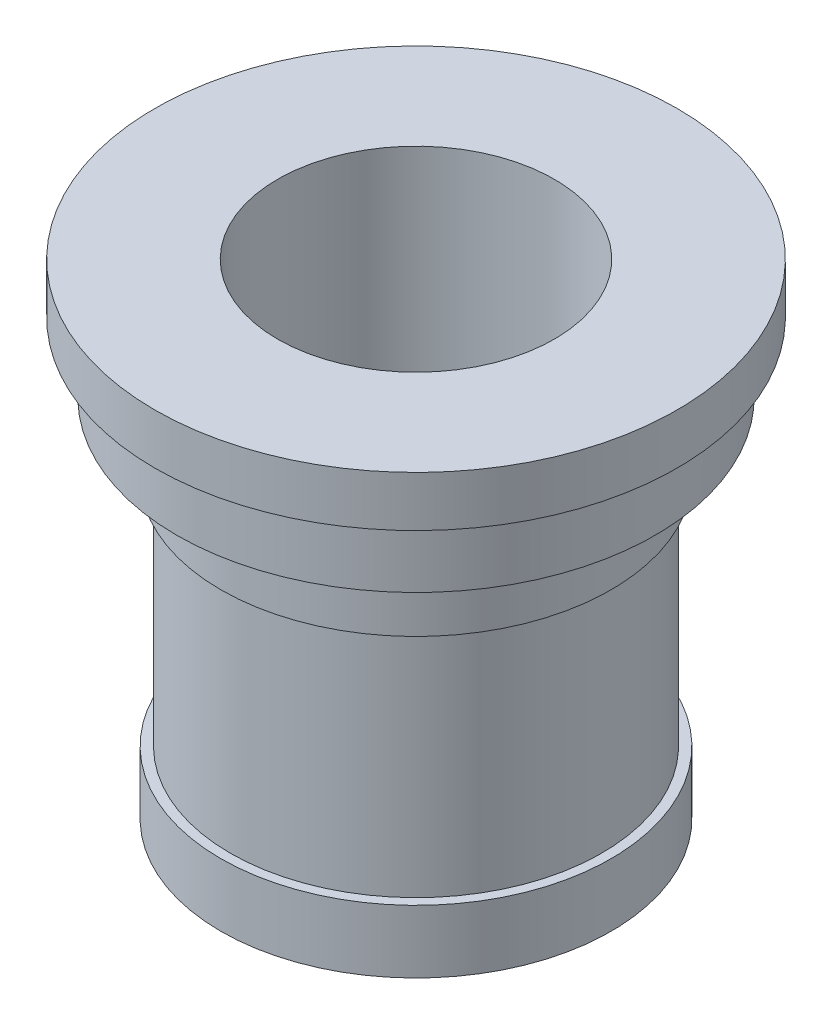
ISO-10303-21;
HEADER;
FILE_DESCRIPTION(('STEP AP214'),'2;1');
FILE_NAME('part.step','',(''),(''),'','','');
FILE_SCHEMA(('AUTOMOTIVE_DESIGN { 1 0 10303 214 1 1 1 1 }'));
ENDSEC;
DATA;
#1=APPLICATION_CONTEXT('core data for automotive mechanical design processes');
#2=APPLICATION_PROTOCOL_DEFINITION('international standard','automotive_design',2000,#1);
#3=PRODUCT_CONTEXT('',#1,'mechanical');
#4=PRODUCT('Part','Part','',(#3));
#5=PRODUCT_RELATED_PRODUCT_CATEGORY('part','',(#4));
#6=PRODUCT_DEFINITION_FORMATION('','',#4);
#7=PRODUCT_DEFINITION_CONTEXT('part definition',#1,'design');
#8=PRODUCT_DEFINITION('design','',#6,#7);
#9=PRODUCT_DEFINITION_SHAPE('','',#8);
#10=(LENGTH_UNIT() NAMED_UNIT(*) SI_UNIT(.MILLI.,.METRE.));
#11=(NAMED_UNIT(*) PLANE_ANGLE_UNIT() SI_UNIT($,.RADIAN.));
#12=(NAMED_UNIT(*) SI_UNIT($,.STERADIAN.) SOLID_ANGLE_UNIT());
#13=UNCERTAINTY_MEASURE_WITH_UNIT(LENGTH_MEASURE(1.E-05),#10,'distance_accuracy_value','');
#14=(GEOMETRIC_REPRESENTATION_CONTEXT(3) GLOBAL_UNCERTAINTY_ASSIGNED_CONTEXT((#13)) GLOBAL_UNIT_ASSIGNED_CONTEXT((#10,
#11,#12)) REPRESENTATION_CONTEXT('',''));
#15=CARTESIAN_POINT('',(0.,0.,0.));
#16=DIRECTION('',(0.,0.,1.));
#17=DIRECTION('',(1.,0.,0.));
#18=AXIS2_PLACEMENT_3D('',#15,#16,#17);
#19=CARTESIAN_POINT('',(0.,10.,0.));
#20=DIRECTION('',(0.,-1.,0.));
#21=DIRECTION('',(0.,0.,-1.));
#22=AXIS2_PLACEMENT_3D('',#19,#20,#21);
#23=CYLINDRICAL_SURFACE('',#22,31.);
#24=CARTESIAN_POINT('',(0.,10.,0.));
#25=DIRECTION('',(0.,1.,0.));
#26=DIRECTION('',(0.,0.,1.));
#27=AXIS2_PLACEMENT_3D('',#24,#25,#26);
#28=CIRCLE('',#27,31.);
#29=CARTESIAN_POINT('',(0.,10.,31.));
#30=VERTEX_POINT('',#29);
#31=EDGE_CURVE('E102',#30,#30,#28,.T.);
#32=ORIENTED_EDGE('',*,*,#31,.F.);
#33=EDGE_LOOP('',(#32));
#34=FACE_BOUND('',#33,.T.);
#35=CARTESIAN_POINT('',(0.,0.,0.));
#36=DIRECTION('',(0.,1.,0.));
#37=DIRECTION('',(0.,0.,1.));
#38=AXIS2_PLACEMENT_3D('',#35,#36,#37);
#39=CIRCLE('',#38,31.);
#40=CARTESIAN_POINT('',(0.,0.,31.));
#41=VERTEX_POINT('',#40);
#42=EDGE_CURVE('E99',#41,#41,#39,.T.);
#43=ORIENTED_EDGE('',*,*,#42,.T.);
#44=EDGE_LOOP('',(#43));
#45=FACE_BOUND('',#44,.T.);
#46=ADVANCED_FACE('F33',(#34,#45),#23,.T.);
#47=CARTESIAN_POINT('',(0.,10.,0.));
#48=DIRECTION('',(0.,1.,0.));
#49=DIRECTION('',(0.,0.,1.));
#50=AXIS2_PLACEMENT_3D('',#47,#48,#49);
#51=PLANE('',#50);
#52=CARTESIAN_POINT('',(0.,10.,0.));
#53=DIRECTION('',(0.,1.,0.));
#54=DIRECTION('',(0.,0.,1.));
#55=AXIS2_PLACEMENT_3D('',#52,#53,#54);
#56=CIRCLE('',#55,29.5);
#57=CARTESIAN_POINT('',(0.,10.,29.5));
#58=VERTEX_POINT('',#57);
#59=EDGE_CURVE('E93',#58,#58,#56,.T.);
#60=ORIENTED_EDGE('',*,*,#59,.F.);
#61=EDGE_LOOP('',(#60));
#62=FACE_BOUND('',#61,.T.);
#63=ORIENTED_EDGE('',*,*,#31,.T.);
#64=EDGE_LOOP('',(#63));
#65=FACE_BOUND('',#64,.T.);
#66=ADVANCED_FACE('F111',(#62,#65),#51,.T.);
#67=CARTESIAN_POINT('',(0.,0.,0.));
#68=DIRECTION('',(0.,1.,0.));
#69=DIRECTION('',(0.,0.,1.));
#70=AXIS2_PLACEMENT_3D('',#67,#68,#69);
#71=PLANE('',#70);
#72=CARTESIAN_POINT('',(0.,0.,0.));
#73=DIRECTION('',(0.,1.,0.));
#74=DIRECTION('',(0.,0.,1.));
#75=AXIS2_PLACEMENT_3D('',#72,#73,#74);
#76=CIRCLE('',#75,22.);
#77=CARTESIAN_POINT('',(1.49912810403716,0.,21.9488636363636));
#78=VERTEX_POINT('',#77);
#79=CARTESIAN_POINT('',(-1.49912810403716,0.,21.9488636363636));
#80=VERTEX_POINT('',#79);
#81=EDGE_CURVE('E67',#78,#80,#76,.T.);
#82=ORIENTED_EDGE('',*,*,#81,.T.);
#83=CARTESIAN_POINT('',(0.,0.,22.));
#84=DIRECTION('',(0.,-1.,0.));
#85=DIRECTION('',(0.,0.,-1.));
#86=AXIS2_PLACEMENT_3D('',#83,#84,#85);
#87=CIRCLE('',#86,1.5);
#88=EDGE_CURVE('E59',#78,#80,#87,.T.);
#89=ORIENTED_EDGE('',*,*,#88,.F.);
#90=EDGE_LOOP('',(#82,#89));
#91=FACE_BOUND('',#90,.T.);
#92=ORIENTED_EDGE('',*,*,#42,.F.);
#93=EDGE_LOOP('',(#92));
#94=FACE_BOUND('',#93,.T.);
#95=ADVANCED_FACE('F65',(#91,#94),#71,.F.);
#96=CARTESIAN_POINT('',(0.,47.,0.));
#97=DIRECTION('',(0.,-1.,0.));
#98=DIRECTION('',(0.,0.,-1.));
#99=AXIS2_PLACEMENT_3D('',#96,#97,#98);
#100=CYLINDRICAL_SURFACE('',#99,29.5);
#101=CARTESIAN_POINT('',(0.,47.,0.));
#102=DIRECTION('',(0.,1.,0.));
#103=DIRECTION('',(0.,0.,1.));
#104=AXIS2_PLACEMENT_3D('',#101,#102,#103);
#105=CIRCLE('',#104,29.5);
#106=CARTESIAN_POINT('',(0.,47.,29.5));
#107=VERTEX_POINT('',#106);
#108=EDGE_CURVE('E96',#107,#107,#105,.T.);
#109=ORIENTED_EDGE('',*,*,#108,.F.);
#110=EDGE_LOOP('',(#109));
#111=FACE_BOUND('',#110,.T.);
#112=ORIENTED_EDGE('',*,*,#59,.T.);
#113=EDGE_LOOP('',(#112));
#114=FACE_BOUND('',#113,.T.);
#115=ADVANCED_FACE('F110',(#111,#114),#100,.T.);
#116=CARTESIAN_POINT('',(0.,58.,0.));
#117=DIRECTION('',(0.,-1.,0.));
#118=DIRECTION('',(0.,0.,-1.));
#119=AXIS2_PLACEMENT_3D('',#116,#117,#118);
#120=CYLINDRICAL_SURFACE('',#119,31.);
#121=CARTESIAN_POINT('',(0.,58.,0.));
#122=DIRECTION('',(0.,1.,0.));
#123=DIRECTION('',(0.,0.,1.));
#124=AXIS2_PLACEMENT_3D('',#121,#122,#123);
#125=CIRCLE('',#124,31.);
#126=CARTESIAN_POINT('',(0.,58.,31.));
#127=VERTEX_POINT('',#126);
#128=EDGE_CURVE('E90',#127,#127,#125,.T.);
#129=ORIENTED_EDGE('',*,*,#128,.F.);
#130=EDGE_LOOP('',(#129));
#131=FACE_BOUND('',#130,.T.);
#132=CARTESIAN_POINT('',(0.,47.,0.));
#133=DIRECTION('',(0.,1.,0.));
#134=DIRECTION('',(0.,0.,1.));
#135=AXIS2_PLACEMENT_3D('',#132,#133,#134);
#136=CIRCLE('',#135,31.);
#137=CARTESIAN_POINT('',(0.,47.,31.));
#138=VERTEX_POINT('',#137);
#139=EDGE_CURVE('E87',#138,#138,#136,.T.);
#140=ORIENTED_EDGE('',*,*,#139,.T.);
#141=EDGE_LOOP('',(#140));
#142=FACE_BOUND('',#141,.T.);
#143=ADVANCED_FACE('F116',(#131,#142),#120,.T.);
#144=CARTESIAN_POINT('',(0.,47.,0.));
#145=DIRECTION('',(0.,1.,0.));
#146=DIRECTION('',(0.,0.,1.));
#147=AXIS2_PLACEMENT_3D('',#144,#145,#146);
#148=PLANE('',#147);
#149=ORIENTED_EDGE('',*,*,#108,.T.);
#150=EDGE_LOOP('',(#149));
#151=FACE_BOUND('',#150,.T.);
#152=ORIENTED_EDGE('',*,*,#139,.F.);
#153=EDGE_LOOP('',(#152));
#154=FACE_BOUND('',#153,.T.);
#155=ADVANCED_FACE('F147',(#151,#154),#148,.F.);
#156=CARTESIAN_POINT('',(0.,69.,0.));
#157=DIRECTION('',(0.,-1.,0.));
#158=DIRECTION('',(0.,0.,-1.));
#159=AXIS2_PLACEMENT_3D('',#156,#157,#158);
#160=CYLINDRICAL_SURFACE('',#159,38.);
#161=CARTESIAN_POINT('',(0.,69.,0.));
#162=DIRECTION('',(0.,1.,0.));
#163=DIRECTION('',(0.,0.,1.));
#164=AXIS2_PLACEMENT_3D('',#161,#162,#163);
#165=CIRCLE('',#164,38.);
#166=CARTESIAN_POINT('',(0.,69.,38.));
#167=VERTEX_POINT('',#166);
#168=EDGE_CURVE('E84',#167,#167,#165,.T.);
#169=ORIENTED_EDGE('',*,*,#168,.F.);
#170=EDGE_LOOP('',(#169));
#171=FACE_BOUND('',#170,.T.);
#172=CARTESIAN_POINT('',(0.,58.,0.));
#173=DIRECTION('',(0.,1.,0.));
#174=DIRECTION('',(0.,0.,1.));
#175=AXIS2_PLACEMENT_3D('',#172,#173,#174);
#176=CIRCLE('',#175,38.);
#177=CARTESIAN_POINT('',(0.,58.,38.));
#178=VERTEX_POINT('',#177);
#179=EDGE_CURVE('E82',#178,#178,#176,.T.);
#180=ORIENTED_EDGE('',*,*,#179,.T.);
#181=EDGE_LOOP('',(#180));
#182=FACE_BOUND('',#181,.T.);
#183=ADVANCED_FACE('F157',(#171,#182),#160,.T.);
#184=CARTESIAN_POINT('',(0.,58.,0.));
#185=DIRECTION('',(0.,1.,0.));
#186=DIRECTION('',(0.,0.,1.));
#187=AXIS2_PLACEMENT_3D('',#184,#185,#186);
#188=PLANE('',#187);
#189=ORIENTED_EDGE('',*,*,#128,.T.);
#190=EDGE_LOOP('',(#189));
#191=FACE_BOUND('',#190,.T.);
#192=ORIENTED_EDGE('',*,*,#179,.F.);
#193=EDGE_LOOP('',(#192));
#194=FACE_BOUND('',#193,.T.);
#195=ADVANCED_FACE('F167',(#191,#194),#188,.F.);
#196=CARTESIAN_POINT('',(0.,77.,0.));
#197=DIRECTION('',(0.,-1.,0.));
#198=DIRECTION('',(0.,0.,-1.));
#199=AXIS2_PLACEMENT_3D('',#196,#197,#198);
#200=CYLINDRICAL_SURFACE('',#199,41.5);
#201=CARTESIAN_POINT('',(0.,77.,0.));
#202=DIRECTION('',(0.,1.,0.));
#203=DIRECTION('',(0.,0.,1.));
#204=AXIS2_PLACEMENT_3D('',#201,#202,#203);
#205=CIRCLE('',#204,41.5);
#206=CARTESIAN_POINT('',(0.,77.,41.5));
#207=VERTEX_POINT('',#206);
#208=EDGE_CURVE('E75',#207,#207,#205,.T.);
#209=ORIENTED_EDGE('',*,*,#208,.F.);
#210=EDGE_LOOP('',(#209));
#211=FACE_BOUND('',#210,.T.);
#212=CARTESIAN_POINT('',(0.,69.,0.));
#213=DIRECTION('',(0.,1.,0.));
#214=DIRECTION('',(0.,0.,1.));
#215=AXIS2_PLACEMENT_3D('',#212,#213,#214);
#216=CIRCLE('',#215,41.5);
#217=CARTESIAN_POINT('',(0.,69.,41.5));
#218=VERTEX_POINT('',#217);
#219=EDGE_CURVE('E71',#218,#218,#216,.T.);
#220=ORIENTED_EDGE('',*,*,#219,.T.);
#221=EDGE_LOOP('',(#220));
#222=FACE_BOUND('',#221,.T.);
#223=ADVANCED_FACE('F177',(#211,#222),#200,.T.);
#224=CARTESIAN_POINT('',(0.,77.,0.));
#225=DIRECTION('',(0.,1.,0.));
#226=DIRECTION('',(0.,0.,1.));
#227=AXIS2_PLACEMENT_3D('',#224,#225,#226);
#228=PLANE('',#227);
#229=CARTESIAN_POINT('',(0.,77.,0.));
#230=DIRECTION('',(0.,1.,0.));
#231=DIRECTION('',(0.,0.,1.));
#232=AXIS2_PLACEMENT_3D('',#229,#230,#231);
#233=CIRCLE('',#232,22.);
#234=CARTESIAN_POINT('',(0.,77.,22.));
#235=VERTEX_POINT('',#234);
#236=EDGE_CURVE('E72',#235,#235,#233,.T.);
#237=ORIENTED_EDGE('',*,*,#236,.F.);
#238=EDGE_LOOP('',(#237));
#239=FACE_BOUND('',#238,.T.);
#240=ORIENTED_EDGE('',*,*,#208,.T.);
#241=EDGE_LOOP('',(#240));
#242=FACE_BOUND('',#241,.T.);
#243=ADVANCED_FACE('F187',(#239,#242),#228,.T.);
#244=CARTESIAN_POINT('',(0.,69.,0.));
#245=DIRECTION('',(0.,1.,0.));
#246=DIRECTION('',(0.,0.,1.));
#247=AXIS2_PLACEMENT_3D('',#244,#245,#246);
#248=PLANE('',#247);
#249=ORIENTED_EDGE('',*,*,#168,.T.);
#250=EDGE_LOOP('',(#249));
#251=FACE_BOUND('',#250,.T.);
#252=ORIENTED_EDGE('',*,*,#219,.F.);
#253=EDGE_LOOP('',(#252));
#254=FACE_BOUND('',#253,.T.);
#255=ADVANCED_FACE('F195',(#251,#254),#248,.F.);
#256=CARTESIAN_POINT('',(0.,0.,0.));
#257=DIRECTION('',(0.,1.,0.));
#258=DIRECTION('',(0.,0.,1.));
#259=AXIS2_PLACEMENT_3D('',#256,#257,#258);
#260=CYLINDRICAL_SURFACE('',#259,22.);
#261=ORIENTED_EDGE('',*,*,#81,.F.);
#262=DIRECTION('',(0.,-1.,0.));
#263=VECTOR('',#262,1.);
#264=CARTESIAN_POINT('',(1.49912810403716,2.5,21.9488636363636));
#265=LINE('',#264,#263);
#266=CARTESIAN_POINT('',(1.49912810403716,5.,21.9488636363636));
#267=VERTEX_POINT('',#266);
#268=EDGE_CURVE('E11',#78,#267,#265,.F.);
#269=ORIENTED_EDGE('',*,*,#268,.T.);
#270=CARTESIAN_POINT('',(0.,5.,0.));
#271=DIRECTION('',(0.,-1.,0.));
#272=DIRECTION('',(0.,0.,-1.));
#273=AXIS2_PLACEMENT_3D('',#270,#271,#272);
#274=CIRCLE('',#273,22.);
#275=CARTESIAN_POINT('',(-1.49912810403716,5.,21.9488636363636));
#276=VERTEX_POINT('',#275);
#277=EDGE_CURVE('E50',#276,#267,#274,.F.);
#278=ORIENTED_EDGE('',*,*,#277,.F.);
#279=DIRECTION('',(0.,-1.,0.));
#280=VECTOR('',#279,1.);
#281=CARTESIAN_POINT('',(-1.49912810403716,2.5,21.9488636363636));
#282=LINE('',#281,#280);
#283=EDGE_CURVE('E40',#276,#80,#282,.T.);
#284=ORIENTED_EDGE('',*,*,#283,.T.);
#285=EDGE_LOOP('',(#261,#269,#278,#284));
#286=FACE_BOUND('',#285,.T.);
#287=ORIENTED_EDGE('',*,*,#236,.T.);
#288=EDGE_LOOP('',(#287));
#289=FACE_BOUND('',#288,.T.);
#290=ADVANCED_FACE('F69',(#286,#289),#260,.F.);
#291=CARTESIAN_POINT('',(0.,5.,22.));
#292=DIRECTION('',(0.,-1.,0.));
#293=DIRECTION('',(0.,0.,-1.));
#294=AXIS2_PLACEMENT_3D('',#291,#292,#293);
#295=CYLINDRICAL_SURFACE('',#294,1.5);
#296=ORIENTED_EDGE('',*,*,#88,.T.);
#297=ORIENTED_EDGE('',*,*,#283,.F.);
#298=CARTESIAN_POINT('',(0.,5.,22.));
#299=DIRECTION('',(0.,-1.,0.));
#300=DIRECTION('',(0.,0.,-1.));
#301=AXIS2_PLACEMENT_3D('',#298,#299,#300);
#302=CIRCLE('',#301,1.5);
#303=EDGE_CURVE('E46',#267,#276,#302,.T.);
#304=ORIENTED_EDGE('',*,*,#303,.F.);
#305=ORIENTED_EDGE('',*,*,#268,.F.);
#306=EDGE_LOOP('',(#296,#297,#304,#305));
#307=FACE_BOUND('',#306,.T.);
#308=ADVANCED_FACE('F58',(#307),#295,.F.);
#309=CARTESIAN_POINT('',(0.,5.,22.));
#310=DIRECTION('',(0.,-1.,0.));
#311=DIRECTION('',(0.,0.,-1.));
#312=AXIS2_PLACEMENT_3D('',#309,#310,#311);
#313=PLANE('',#312);
#314=ORIENTED_EDGE('',*,*,#277,.T.);
#315=ORIENTED_EDGE('',*,*,#303,.T.);
#316=EDGE_LOOP('',(#314,#315));
#317=FACE_BOUND('',#316,.T.);
#318=ADVANCED_FACE('F227',(#317),#313,.T.);
#319=CLOSED_SHELL('',(#46,#66,#95,#115,#143,#155,#183,#195,#223,#243,#255,#290,#308,#318));
#320=MANIFOLD_SOLID_BREP('B2',#319);
#321=ADVANCED_BREP_SHAPE_REPRESENTATION('',(#18,#320),#14);
#322=SHAPE_DEFINITION_REPRESENTATION(#9,#321);
ENDSEC;
END-ISO-10303-21;
